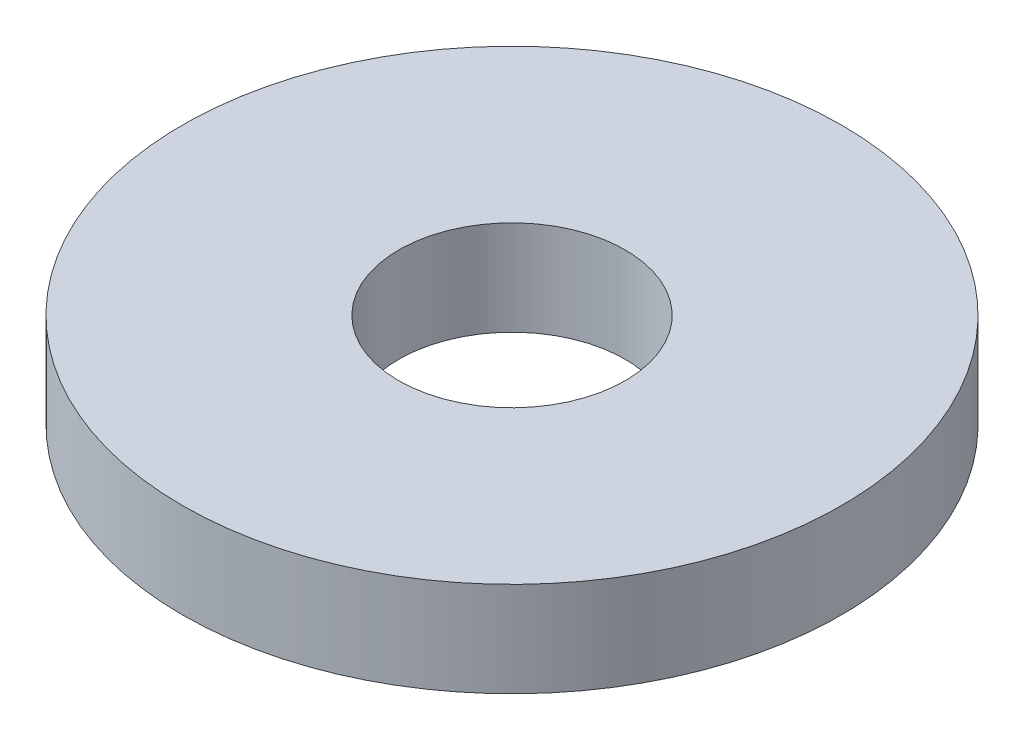
ISO-10303-21;
HEADER;
FILE_DESCRIPTION(('STEP AP214'),'2;1');
FILE_NAME('part.step','',(''),(''),'','','');
FILE_SCHEMA(('AUTOMOTIVE_DESIGN { 1 0 10303 214 1 1 1 1 }'));
ENDSEC;
DATA;
#1=APPLICATION_CONTEXT('core data for automotive mechanical design processes');
#2=APPLICATION_PROTOCOL_DEFINITION('international standard','automotive_design',2000,#1);
#3=PRODUCT_CONTEXT('',#1,'mechanical');
#4=PRODUCT('Part','Part','',(#3));
#5=PRODUCT_RELATED_PRODUCT_CATEGORY('part','',(#4));
#6=PRODUCT_DEFINITION_FORMATION('','',#4);
#7=PRODUCT_DEFINITION_CONTEXT('part definition',#1,'design');
#8=PRODUCT_DEFINITION('design','',#6,#7);
#9=PRODUCT_DEFINITION_SHAPE('','',#8);
#10=(LENGTH_UNIT() NAMED_UNIT(*) SI_UNIT(.MILLI.,.METRE.));
#11=(NAMED_UNIT(*) PLANE_ANGLE_UNIT() SI_UNIT($,.RADIAN.));
#12=(NAMED_UNIT(*) SI_UNIT($,.STERADIAN.) SOLID_ANGLE_UNIT());
#13=UNCERTAINTY_MEASURE_WITH_UNIT(LENGTH_MEASURE(1.E-05),#10,'distance_accuracy_value','');
#14=(GEOMETRIC_REPRESENTATION_CONTEXT(3) GLOBAL_UNCERTAINTY_ASSIGNED_CONTEXT((#13)) GLOBAL_UNIT_ASSIGNED_CONTEXT((#10,
#11,#12)) REPRESENTATION_CONTEXT('',''));
#15=CARTESIAN_POINT('',(0.,0.,0.));
#16=DIRECTION('',(0.,0.,1.));
#17=DIRECTION('',(1.,0.,0.));
#18=AXIS2_PLACEMENT_3D('',#15,#16,#17);
#19=CARTESIAN_POINT('',(0.,23.,0.));
#20=DIRECTION('',(0.,-1.,0.));
#21=DIRECTION('',(0.,0.,-1.));
#22=AXIS2_PLACEMENT_3D('',#19,#20,#21);
#23=CYLINDRICAL_SURFACE('',#22,80.);
#24=CARTESIAN_POINT('',(0.,23.,0.));
#25=DIRECTION('',(0.,1.,0.));
#26=DIRECTION('',(0.,0.,1.));
#27=AXIS2_PLACEMENT_3D('',#24,#25,#26);
#28=CIRCLE('',#27,80.);
#29=CARTESIAN_POINT('',(0.,23.,80.));
#30=VERTEX_POINT('',#29);
#31=EDGE_CURVE('E10',#30,#30,#28,.T.);
#32=ORIENTED_EDGE('',*,*,#31,.F.);
#33=EDGE_LOOP('',(#32));
#34=FACE_BOUND('',#33,.T.);
#35=CARTESIAN_POINT('',(0.,0.,0.));
#36=DIRECTION('',(0.,1.,0.));
#37=DIRECTION('',(0.,0.,1.));
#38=AXIS2_PLACEMENT_3D('',#35,#36,#37);
#39=CIRCLE('',#38,80.);
#40=CARTESIAN_POINT('',(0.,0.,80.));
#41=VERTEX_POINT('',#40);
#42=EDGE_CURVE('E37',#41,#41,#39,.T.);
#43=ORIENTED_EDGE('',*,*,#42,.T.);
#44=EDGE_LOOP('',(#43));
#45=FACE_BOUND('',#44,.T.);
#46=ADVANCED_FACE('F40',(#34,#45),#23,.T.);
#47=CARTESIAN_POINT('',(0.,23.,0.));
#48=DIRECTION('',(0.,1.,0.));
#49=DIRECTION('',(0.,0.,1.));
#50=AXIS2_PLACEMENT_3D('',#47,#48,#49);
#51=PLANE('',#50);
#52=CARTESIAN_POINT('',(0.,23.,0.));
#53=DIRECTION('',(0.,1.,0.));
#54=DIRECTION('',(0.,0.,1.));
#55=AXIS2_PLACEMENT_3D('',#52,#53,#54);
#56=CIRCLE('',#55,27.5);
#57=CARTESIAN_POINT('',(0.,23.,27.5));
#58=VERTEX_POINT('',#57);
#59=EDGE_CURVE('E50',#58,#58,#56,.T.);
#60=ORIENTED_EDGE('',*,*,#59,.F.);
#61=EDGE_LOOP('',(#60));
#62=FACE_BOUND('',#61,.T.);
#63=ORIENTED_EDGE('',*,*,#31,.T.);
#64=EDGE_LOOP('',(#63));
#65=FACE_BOUND('',#64,.T.);
#66=ADVANCED_FACE('F59',(#62,#65),#51,.T.);
#67=CARTESIAN_POINT('',(0.,0.,0.));
#68=DIRECTION('',(0.,1.,0.));
#69=DIRECTION('',(0.,0.,1.));
#70=AXIS2_PLACEMENT_3D('',#67,#68,#69);
#71=PLANE('',#70);
#72=CARTESIAN_POINT('',(0.,0.,0.));
#73=DIRECTION('',(0.,1.,0.));
#74=DIRECTION('',(0.,0.,1.));
#75=AXIS2_PLACEMENT_3D('',#72,#73,#74);
#76=CIRCLE('',#75,27.5);
#77=CARTESIAN_POINT('',(0.,0.,27.5));
#78=VERTEX_POINT('',#77);
#79=EDGE_CURVE('E47',#78,#78,#76,.T.);
#80=ORIENTED_EDGE('',*,*,#79,.T.);
#81=EDGE_LOOP('',(#80));
#82=FACE_BOUND('',#81,.T.);
#83=ORIENTED_EDGE('',*,*,#42,.F.);
#84=EDGE_LOOP('',(#83));
#85=FACE_BOUND('',#84,.T.);
#86=ADVANCED_FACE('F58',(#82,#85),#71,.F.);
#87=CARTESIAN_POINT('',(0.,23.,0.));
#88=DIRECTION('',(0.,-1.,0.));
#89=DIRECTION('',(0.,0.,-1.));
#90=AXIS2_PLACEMENT_3D('',#87,#88,#89);
#91=CYLINDRICAL_SURFACE('',#90,27.5);
#92=ORIENTED_EDGE('',*,*,#59,.T.);
#93=EDGE_LOOP('',(#92));
#94=FACE_BOUND('',#93,.T.);
#95=ORIENTED_EDGE('',*,*,#79,.F.);
#96=EDGE_LOOP('',(#95));
#97=FACE_BOUND('',#96,.T.);
#98=ADVANCED_FACE('F54',(#94,#97),#91,.F.);
#99=CLOSED_SHELL('',(#46,#66,#86,#98));
#100=MANIFOLD_SOLID_BREP('B2',#99);
#101=ADVANCED_BREP_SHAPE_REPRESENTATION('',(#18,#100),#14);
#102=SHAPE_DEFINITION_REPRESENTATION(#9,#101);
ENDSEC;
END-ISO-10303-21;
